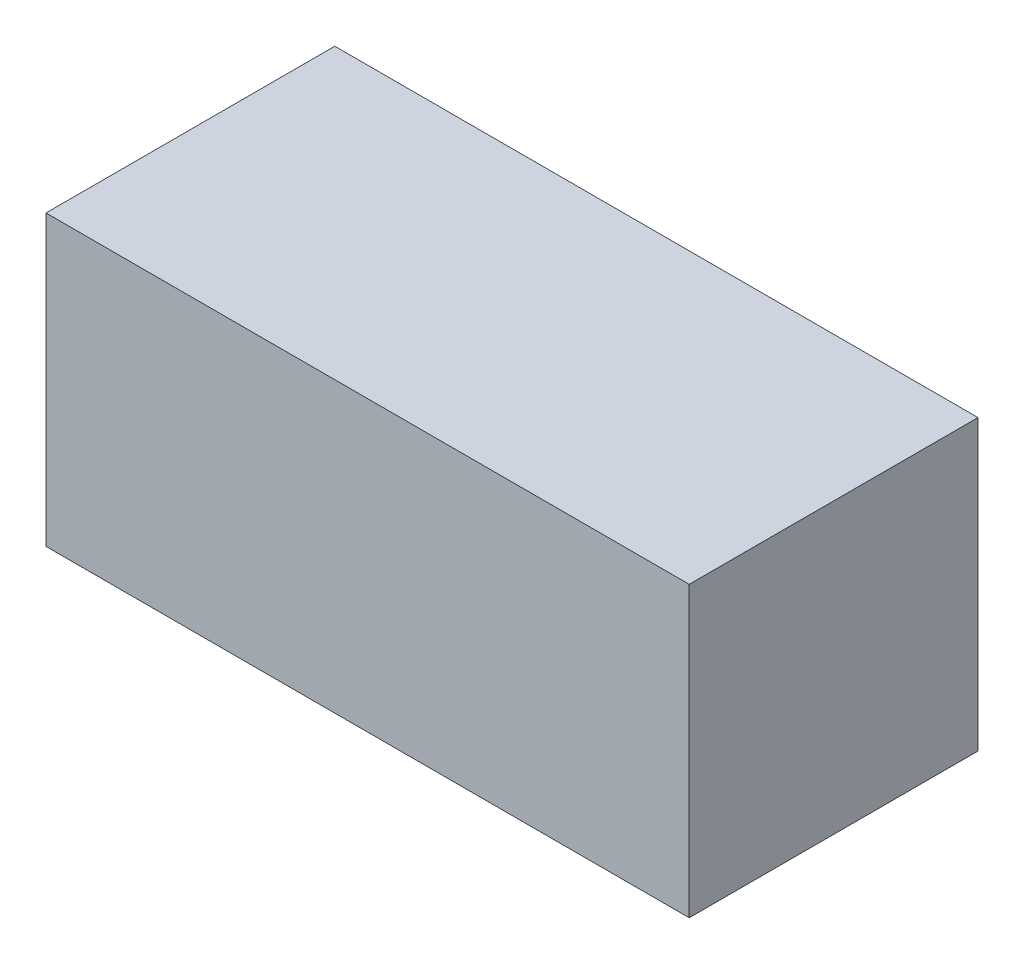
ISO-10303-21;
HEADER;
FILE_DESCRIPTION(('STEP AP214'),'2;1');
FILE_NAME('part.step','',(''),(''),'','','');
FILE_SCHEMA(('AUTOMOTIVE_DESIGN { 1 0 10303 214 1 1 1 1 }'));
ENDSEC;
DATA;
#1=APPLICATION_CONTEXT('core data for automotive mechanical design processes');
#2=APPLICATION_PROTOCOL_DEFINITION('international standard','automotive_design',2000,#1);
#3=PRODUCT_CONTEXT('',#1,'mechanical');
#4=PRODUCT('Part','Part','',(#3));
#5=PRODUCT_RELATED_PRODUCT_CATEGORY('part','',(#4));
#6=PRODUCT_DEFINITION_FORMATION('','',#4);
#7=PRODUCT_DEFINITION_CONTEXT('part definition',#1,'design');
#8=PRODUCT_DEFINITION('design','',#6,#7);
#9=PRODUCT_DEFINITION_SHAPE('','',#8);
#10=(LENGTH_UNIT() NAMED_UNIT(*) SI_UNIT(.MILLI.,.METRE.));
#11=(NAMED_UNIT(*) PLANE_ANGLE_UNIT() SI_UNIT($,.RADIAN.));
#12=(NAMED_UNIT(*) SI_UNIT($,.STERADIAN.) SOLID_ANGLE_UNIT());
#13=UNCERTAINTY_MEASURE_WITH_UNIT(LENGTH_MEASURE(1.E-05),#10,'distance_accuracy_value','');
#14=(GEOMETRIC_REPRESENTATION_CONTEXT(3) GLOBAL_UNCERTAINTY_ASSIGNED_CONTEXT((#13)) GLOBAL_UNIT_ASSIGNED_CONTEXT((#10,
#11,#12)) REPRESENTATION_CONTEXT('',''));
#15=CARTESIAN_POINT('',(0.,0.,0.));
#16=DIRECTION('',(0.,0.,1.));
#17=DIRECTION('',(1.,0.,0.));
#18=AXIS2_PLACEMENT_3D('',#15,#16,#17);
#19=CARTESIAN_POINT('',(2450.,2200.,-1100.));
#20=DIRECTION('',(-1.,0.,0.));
#21=DIRECTION('',(0.,0.,1.));
#22=AXIS2_PLACEMENT_3D('',#19,#20,#21);
#23=PLANE('',#22);
#24=DIRECTION('',(0.,0.,-1.));
#25=VECTOR('',#24,1.);
#26=CARTESIAN_POINT('',(2450.,0.,-1100.));
#27=LINE('',#26,#25);
#28=CARTESIAN_POINT('',(2450.,0.,1100.));
#29=VERTEX_POINT('',#28);
#30=CARTESIAN_POINT('',(2450.,0.,-1100.));
#31=VERTEX_POINT('',#30);
#32=EDGE_CURVE('E96',#29,#31,#27,.T.);
#33=ORIENTED_EDGE('',*,*,#32,.T.);
#34=DIRECTION('',(0.,-1.,0.));
#35=VECTOR('',#34,1.);
#36=CARTESIAN_POINT('',(2450.,2200.,-1100.));
#37=LINE('',#36,#35);
#38=CARTESIAN_POINT('',(2450.,2200.,-1100.));
#39=VERTEX_POINT('',#38);
#40=EDGE_CURVE('E11',#39,#31,#37,.T.);
#41=ORIENTED_EDGE('',*,*,#40,.F.);
#42=DIRECTION('',(0.,0.,-1.));
#43=VECTOR('',#42,1.);
#44=CARTESIAN_POINT('',(2450.,2200.,-1100.));
#45=LINE('',#44,#43);
#46=CARTESIAN_POINT('',(2450.,2200.,1100.));
#47=VERTEX_POINT('',#46);
#48=EDGE_CURVE('E84',#47,#39,#45,.T.);
#49=ORIENTED_EDGE('',*,*,#48,.F.);
#50=DIRECTION('',(0.,-1.,0.));
#51=VECTOR('',#50,1.);
#52=CARTESIAN_POINT('',(2450.,2200.,1100.));
#53=LINE('',#52,#51);
#54=EDGE_CURVE('E92',#47,#29,#53,.T.);
#55=ORIENTED_EDGE('',*,*,#54,.T.);
#56=EDGE_LOOP('',(#33,#41,#49,#55));
#57=FACE_BOUND('',#56,.T.);
#58=ADVANCED_FACE('F33',(#57),#23,.F.);
#59=CARTESIAN_POINT('',(-2450.,2200.,-1100.));
#60=DIRECTION('',(0.,0.,1.));
#61=DIRECTION('',(1.,0.,0.));
#62=AXIS2_PLACEMENT_3D('',#59,#60,#61);
#63=PLANE('',#62);
#64=DIRECTION('',(-1.,0.,0.));
#65=VECTOR('',#64,1.);
#66=CARTESIAN_POINT('',(-2450.,0.,-1100.));
#67=LINE('',#66,#65);
#68=CARTESIAN_POINT('',(-2450.,0.,-1100.));
#69=VERTEX_POINT('',#68);
#70=EDGE_CURVE('E88',#31,#69,#67,.T.);
#71=ORIENTED_EDGE('',*,*,#70,.T.);
#72=DIRECTION('',(0.,-1.,0.));
#73=VECTOR('',#72,1.);
#74=CARTESIAN_POINT('',(-2450.,2200.,-1100.));
#75=LINE('',#74,#73);
#76=CARTESIAN_POINT('',(-2450.,2200.,-1100.));
#77=VERTEX_POINT('',#76);
#78=EDGE_CURVE('E41',#77,#69,#75,.T.);
#79=ORIENTED_EDGE('',*,*,#78,.F.);
#80=DIRECTION('',(-1.,0.,0.));
#81=VECTOR('',#80,1.);
#82=CARTESIAN_POINT('',(-2450.,2200.,-1100.));
#83=LINE('',#82,#81);
#84=EDGE_CURVE('E79',#39,#77,#83,.T.);
#85=ORIENTED_EDGE('',*,*,#84,.F.);
#86=ORIENTED_EDGE('',*,*,#40,.T.);
#87=EDGE_LOOP('',(#71,#79,#85,#86));
#88=FACE_BOUND('',#87,.T.);
#89=ADVANCED_FACE('F87',(#88),#63,.F.);
#90=CARTESIAN_POINT('',(-2450.,2200.,-1100.));
#91=DIRECTION('',(1.,0.,0.));
#92=DIRECTION('',(0.,0.,-1.));
#93=AXIS2_PLACEMENT_3D('',#90,#91,#92);
#94=PLANE('',#93);
#95=DIRECTION('',(0.,0.,1.));
#96=VECTOR('',#95,1.);
#97=CARTESIAN_POINT('',(-2450.,0.,-1100.));
#98=LINE('',#97,#96);
#99=CARTESIAN_POINT('',(-2450.,0.,1100.));
#100=VERTEX_POINT('',#99);
#101=EDGE_CURVE('E66',#69,#100,#98,.T.);
#102=ORIENTED_EDGE('',*,*,#101,.T.);
#103=DIRECTION('',(0.,-1.,0.));
#104=VECTOR('',#103,1.);
#105=CARTESIAN_POINT('',(-2450.,2200.,1100.));
#106=LINE('',#105,#104);
#107=CARTESIAN_POINT('',(-2450.,2200.,1100.));
#108=VERTEX_POINT('',#107);
#109=EDGE_CURVE('E89',#108,#100,#106,.T.);
#110=ORIENTED_EDGE('',*,*,#109,.F.);
#111=DIRECTION('',(0.,0.,1.));
#112=VECTOR('',#111,1.);
#113=CARTESIAN_POINT('',(-2450.,2200.,-1100.));
#114=LINE('',#113,#112);
#115=EDGE_CURVE('E82',#77,#108,#114,.T.);
#116=ORIENTED_EDGE('',*,*,#115,.F.);
#117=ORIENTED_EDGE('',*,*,#78,.T.);
#118=EDGE_LOOP('',(#102,#110,#116,#117));
#119=FACE_BOUND('',#118,.T.);
#120=ADVANCED_FACE('F90',(#119),#94,.F.);
#121=CARTESIAN_POINT('',(-2450.,2200.,1100.));
#122=DIRECTION('',(0.,0.,-1.));
#123=DIRECTION('',(-1.,0.,0.));
#124=AXIS2_PLACEMENT_3D('',#121,#122,#123);
#125=PLANE('',#124);
#126=DIRECTION('',(1.,0.,0.));
#127=VECTOR('',#126,1.);
#128=CARTESIAN_POINT('',(-2450.,0.,1100.));
#129=LINE('',#128,#127);
#130=EDGE_CURVE('E72',#100,#29,#129,.T.);
#131=ORIENTED_EDGE('',*,*,#130,.T.);
#132=ORIENTED_EDGE('',*,*,#54,.F.);
#133=DIRECTION('',(1.,0.,0.));
#134=VECTOR('',#133,1.);
#135=CARTESIAN_POINT('',(-2450.,2200.,1100.));
#136=LINE('',#135,#134);
#137=EDGE_CURVE('E49',#108,#47,#136,.T.);
#138=ORIENTED_EDGE('',*,*,#137,.F.);
#139=ORIENTED_EDGE('',*,*,#109,.T.);
#140=EDGE_LOOP('',(#131,#132,#138,#139));
#141=FACE_BOUND('',#140,.T.);
#142=ADVANCED_FACE('F103',(#141),#125,.F.);
#143=CARTESIAN_POINT('',(0.,2200.,0.));
#144=DIRECTION('',(0.,1.,0.));
#145=DIRECTION('',(0.,0.,1.));
#146=AXIS2_PLACEMENT_3D('',#143,#144,#145);
#147=PLANE('',#146);
#148=ORIENTED_EDGE('',*,*,#48,.T.);
#149=ORIENTED_EDGE('',*,*,#84,.T.);
#150=ORIENTED_EDGE('',*,*,#115,.T.);
#151=ORIENTED_EDGE('',*,*,#137,.T.);
#152=EDGE_LOOP('',(#148,#149,#150,#151));
#153=FACE_BOUND('',#152,.T.);
#154=ADVANCED_FACE('F80',(#153),#147,.T.);
#155=CARTESIAN_POINT('',(0.,0.,0.));
#156=DIRECTION('',(0.,1.,0.));
#157=DIRECTION('',(0.,0.,1.));
#158=AXIS2_PLACEMENT_3D('',#155,#156,#157);
#159=PLANE('',#158);
#160=ORIENTED_EDGE('',*,*,#32,.F.);
#161=ORIENTED_EDGE('',*,*,#130,.F.);
#162=ORIENTED_EDGE('',*,*,#101,.F.);
#163=ORIENTED_EDGE('',*,*,#70,.F.);
#164=EDGE_LOOP('',(#160,#161,#162,#163));
#165=FACE_BOUND('',#164,.T.);
#166=ADVANCED_FACE('F106',(#165),#159,.F.);
#167=CLOSED_SHELL('',(#58,#89,#120,#142,#154,#166));
#168=MANIFOLD_SOLID_BREP('B2',#167);
#169=ADVANCED_BREP_SHAPE_REPRESENTATION('',(#18,#168),#14);
#170=SHAPE_DEFINITION_REPRESENTATION(#9,#169);
ENDSEC;
END-ISO-10303-21;
